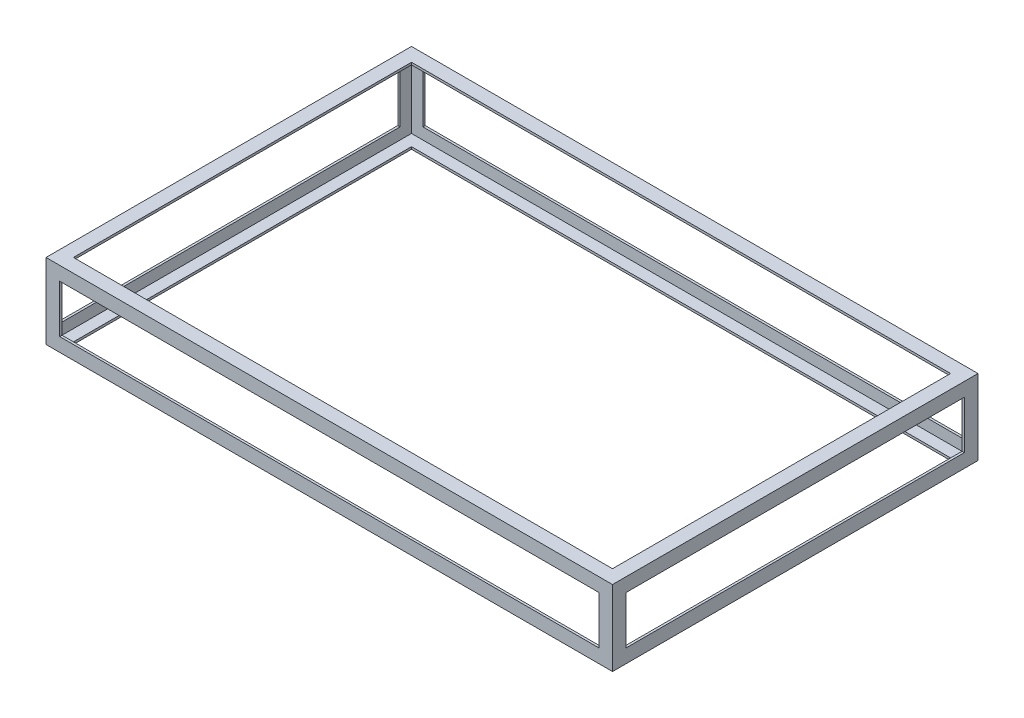
ISO-10303-21;
HEADER;
FILE_DESCRIPTION(('STEP AP214'),'2;1');
FILE_NAME('part.step','',(''),(''),'','','');
FILE_SCHEMA(('AUTOMOTIVE_DESIGN { 1 0 10303 214 1 1 1 1 }'));
ENDSEC;
DATA;
#1=APPLICATION_CONTEXT('core data for automotive mechanical design processes');
#2=APPLICATION_PROTOCOL_DEFINITION('international standard','automotive_design',2000,#1);
#3=PRODUCT_CONTEXT('',#1,'mechanical');
#4=PRODUCT('Part','Part','',(#3));
#5=PRODUCT_RELATED_PRODUCT_CATEGORY('part','',(#4));
#6=PRODUCT_DEFINITION_FORMATION('','',#4);
#7=PRODUCT_DEFINITION_CONTEXT('part definition',#1,'design');
#8=PRODUCT_DEFINITION('design','',#6,#7);
#9=PRODUCT_DEFINITION_SHAPE('','',#8);
#10=(LENGTH_UNIT() NAMED_UNIT(*) SI_UNIT(.MILLI.,.METRE.));
#11=(NAMED_UNIT(*) PLANE_ANGLE_UNIT() SI_UNIT($,.RADIAN.));
#12=(NAMED_UNIT(*) SI_UNIT($,.STERADIAN.) SOLID_ANGLE_UNIT());
#13=UNCERTAINTY_MEASURE_WITH_UNIT(LENGTH_MEASURE(1.E-05),#10,'distance_accuracy_value','');
#14=(GEOMETRIC_REPRESENTATION_CONTEXT(3) GLOBAL_UNCERTAINTY_ASSIGNED_CONTEXT((#13)) GLOBAL_UNIT_ASSIGNED_CONTEXT((#10,
#11,#12)) REPRESENTATION_CONTEXT('',''));
#15=CARTESIAN_POINT('',(0.,0.,0.));
#16=DIRECTION('',(0.,0.,1.));
#17=DIRECTION('',(1.,0.,0.));
#18=AXIS2_PLACEMENT_3D('',#15,#16,#17);
#19=CARTESIAN_POINT('',(1574.8,-304.8,469.9));
#20=DIRECTION('',(0.,0.,1.));
#21=DIRECTION('',(1.,0.,0.));
#22=AXIS2_PLACEMENT_3D('',#19,#20,#21);
#23=PLANE('',#22);
#24=DIRECTION('',(0.,1.,0.));
#25=VECTOR('',#24,1.);
#26=CARTESIAN_POINT('',(1574.8,-304.8,469.9));
#27=LINE('',#26,#25);
#28=CARTESIAN_POINT('',(1574.8,-266.699999999998,469.9));
#29=VERTEX_POINT('',#28);
#30=CARTESIAN_POINT('',(1574.8,-133.349999999999,469.9));
#31=VERTEX_POINT('',#30);
#32=EDGE_CURVE('E461',#29,#31,#27,.T.);
#33=ORIENTED_EDGE('',*,*,#32,.F.);
#34=DIRECTION('',(-1.,-2.44773580232324E-13,0.));
#35=VECTOR('',#34,1.);
#36=CARTESIAN_POINT('',(1574.79999999999,-266.699999999998,469.9));
#37=LINE('',#36,#35);
#38=CARTESIAN_POINT('',(1568.45,-266.7,469.9));
#39=VERTEX_POINT('',#38);
#40=EDGE_CURVE('E276',#29,#39,#37,.T.);
#41=ORIENTED_EDGE('',*,*,#40,.T.);
#42=DIRECTION('',(0.,-1.,0.));
#43=VECTOR('',#42,1.);
#44=CARTESIAN_POINT('',(1568.45,-95.2500000000007,469.9));
#45=LINE('',#44,#43);
#46=CARTESIAN_POINT('',(1568.45,-133.350000000001,469.9));
#47=VERTEX_POINT('',#46);
#48=EDGE_CURVE('E442',#47,#39,#45,.T.);
#49=ORIENTED_EDGE('',*,*,#48,.F.);
#50=DIRECTION('',(1.,2.27289753072872E-13,0.));
#51=VECTOR('',#50,1.);
#52=CARTESIAN_POINT('',(1574.79999999996,-133.349999999999,469.9));
#53=LINE('',#52,#51);
#54=EDGE_CURVE('E312',#47,#31,#53,.T.);
#55=ORIENTED_EDGE('',*,*,#54,.T.);
#56=EDGE_LOOP('',(#33,#41,#49,#55));
#57=FACE_BOUND('',#56,.T.);
#58=ADVANCED_FACE('F37',(#57),#23,.F.);
#59=CARTESIAN_POINT('',(1574.8,-304.8,-469.9));
#60=DIRECTION('',(0.,0.,-1.));
#61=DIRECTION('',(-1.,0.,0.));
#62=AXIS2_PLACEMENT_3D('',#59,#60,#61);
#63=PLANE('',#62);
#64=DIRECTION('',(0.,-1.,0.));
#65=VECTOR('',#64,1.);
#66=CARTESIAN_POINT('',(1568.45,-95.2500000000007,-469.9));
#67=LINE('',#66,#65);
#68=CARTESIAN_POINT('',(1568.45,-133.350000000001,-469.9));
#69=VERTEX_POINT('',#68);
#70=CARTESIAN_POINT('',(1568.45,-266.7,-469.9));
#71=VERTEX_POINT('',#70);
#72=EDGE_CURVE('E52',#69,#71,#67,.T.);
#73=ORIENTED_EDGE('',*,*,#72,.T.);
#74=DIRECTION('',(1.,2.44773580232324E-13,0.));
#75=VECTOR('',#74,1.);
#76=CARTESIAN_POINT('',(1574.79999999999,-266.699999999998,-469.9));
#77=LINE('',#76,#75);
#78=CARTESIAN_POINT('',(1574.8,-266.699999999998,-469.9));
#79=VERTEX_POINT('',#78);
#80=EDGE_CURVE('E274',#71,#79,#77,.T.);
#81=ORIENTED_EDGE('',*,*,#80,.T.);
#82=DIRECTION('',(0.,-1.,0.));
#83=VECTOR('',#82,1.);
#84=CARTESIAN_POINT('',(1574.8,-304.8,-469.9));
#85=LINE('',#84,#83);
#86=CARTESIAN_POINT('',(1574.8,-133.349999999999,-469.9));
#87=VERTEX_POINT('',#86);
#88=EDGE_CURVE('E358',#87,#79,#85,.T.);
#89=ORIENTED_EDGE('',*,*,#88,.F.);
#90=DIRECTION('',(-1.,-2.27289753072872E-13,0.));
#91=VECTOR('',#90,1.);
#92=CARTESIAN_POINT('',(1574.79999999996,-133.349999999999,-469.9));
#93=LINE('',#92,#91);
#94=EDGE_CURVE('E303',#87,#69,#93,.T.);
#95=ORIENTED_EDGE('',*,*,#94,.T.);
#96=EDGE_LOOP('',(#73,#81,#89,#95));
#97=FACE_BOUND('',#96,.T.);
#98=ADVANCED_FACE('F529',(#97),#63,.F.);
#99=DIRECTION('',(0.,-1.,0.));
#100=VECTOR('',#99,1.);
#101=CARTESIAN_POINT('',(6.35000000000008,-95.2500000000007,469.9));
#102=LINE('',#101,#100);
#103=CARTESIAN_POINT('',(6.35000000000008,-133.350000000001,469.9));
#104=VERTEX_POINT('',#103);
#105=CARTESIAN_POINT('',(6.35000000000002,-266.7,469.9));
#106=VERTEX_POINT('',#105);
#107=EDGE_CURVE('E403',#104,#106,#102,.T.);
#108=ORIENTED_EDGE('',*,*,#107,.T.);
#109=DIRECTION('',(-1.,2.44773580232317E-13,0.));
#110=VECTOR('',#109,1.);
#111=CARTESIAN_POINT('',(1574.80000000001,-266.700000000384,469.9));
#112=LINE('',#111,#110);
#113=CARTESIAN_POINT('',(0.,-266.699999999998,469.9));
#114=VERTEX_POINT('',#113);
#115=EDGE_CURVE('E296',#106,#114,#112,.T.);
#116=ORIENTED_EDGE('',*,*,#115,.T.);
#117=DIRECTION('',(0.,1.,0.));
#118=VECTOR('',#117,1.);
#119=CARTESIAN_POINT('',(0.,-304.8,469.9));
#120=LINE('',#119,#118);
#121=CARTESIAN_POINT('',(0.,-133.349999999999,469.9));
#122=VERTEX_POINT('',#121);
#123=EDGE_CURVE('E459',#114,#122,#120,.T.);
#124=ORIENTED_EDGE('',*,*,#123,.T.);
#125=DIRECTION('',(1.,-2.27289753072872E-13,0.));
#126=VECTOR('',#125,1.);
#127=CARTESIAN_POINT('',(1574.80000000004,-133.350000000357,469.9));
#128=LINE('',#127,#126);
#129=EDGE_CURVE('E389',#122,#104,#128,.T.);
#130=ORIENTED_EDGE('',*,*,#129,.T.);
#131=EDGE_LOOP('',(#108,#116,#124,#130));
#132=FACE_BOUND('',#131,.T.);
#133=ADVANCED_FACE('F505',(#132),#23,.F.);
#134=DIRECTION('',(0.,-1.,0.));
#135=VECTOR('',#134,1.);
#136=CARTESIAN_POINT('',(0.,-304.8,-469.9));
#137=LINE('',#136,#135);
#138=CARTESIAN_POINT('',(0.,-133.349999999999,-469.9));
#139=VERTEX_POINT('',#138);
#140=CARTESIAN_POINT('',(0.,-266.699999999998,-469.9));
#141=VERTEX_POINT('',#140);
#142=EDGE_CURVE('E355',#139,#141,#137,.T.);
#143=ORIENTED_EDGE('',*,*,#142,.T.);
#144=DIRECTION('',(1.,-2.44773580232317E-13,0.));
#145=VECTOR('',#144,1.);
#146=CARTESIAN_POINT('',(1574.80000000001,-266.700000000384,-469.9));
#147=LINE('',#146,#145);
#148=CARTESIAN_POINT('',(6.35000000000002,-266.7,-469.9));
#149=VERTEX_POINT('',#148);
#150=EDGE_CURVE('E293',#141,#149,#147,.T.);
#151=ORIENTED_EDGE('',*,*,#150,.T.);
#152=DIRECTION('',(0.,-1.,0.));
#153=VECTOR('',#152,1.);
#154=CARTESIAN_POINT('',(6.35000000000008,-95.2500000000007,-469.9));
#155=LINE('',#154,#153);
#156=CARTESIAN_POINT('',(6.35000000000008,-133.350000000001,-469.9));
#157=VERTEX_POINT('',#156);
#158=EDGE_CURVE('E319',#157,#149,#155,.T.);
#159=ORIENTED_EDGE('',*,*,#158,.F.);
#160=DIRECTION('',(1.,-2.27289753072872E-13,0.));
#161=VECTOR('',#160,1.);
#162=CARTESIAN_POINT('',(6.34999999999986,-133.350000000001,-469.9));
#163=LINE('',#162,#161);
#164=EDGE_CURVE('E45',#139,#157,#163,.T.);
#165=ORIENTED_EDGE('',*,*,#164,.F.);
#166=EDGE_LOOP('',(#143,#151,#159,#165));
#167=FACE_BOUND('',#166,.T.);
#168=ADVANCED_FACE('F499',(#167),#63,.F.);
#169=DIRECTION('',(-1.,0.,0.));
#170=VECTOR('',#169,1.);
#171=CARTESIAN_POINT('',(1574.8,-298.45,469.9));
#172=LINE('',#171,#170);
#173=CARTESIAN_POINT('',(1536.7,-298.45,469.9));
#174=VERTEX_POINT('',#173);
#175=CARTESIAN_POINT('',(38.1,-298.45,469.9));
#176=VERTEX_POINT('',#175);
#177=EDGE_CURVE('E463',#174,#176,#172,.T.);
#178=ORIENTED_EDGE('',*,*,#177,.F.);
#179=DIRECTION('',(0.,-1.,0.));
#180=VECTOR('',#179,1.);
#181=CARTESIAN_POINT('',(1536.7,-304.8,469.9));
#182=LINE('',#181,#180);
#183=CARTESIAN_POINT('',(1536.7,-304.799999999998,469.9));
#184=VERTEX_POINT('',#183);
#185=EDGE_CURVE('E261',#174,#184,#182,.T.);
#186=ORIENTED_EDGE('',*,*,#185,.T.);
#187=DIRECTION('',(-1.,0.,0.));
#188=VECTOR('',#187,1.);
#189=CARTESIAN_POINT('',(1574.8,-304.8,469.9));
#190=LINE('',#189,#188);
#191=CARTESIAN_POINT('',(38.1,-304.799999999998,469.9));
#192=VERTEX_POINT('',#191);
#193=EDGE_CURVE('E471',#184,#192,#190,.T.);
#194=ORIENTED_EDGE('',*,*,#193,.T.);
#195=DIRECTION('',(0.,1.,0.));
#196=VECTOR('',#195,1.);
#197=CARTESIAN_POINT('',(38.1,-304.8,469.9));
#198=LINE('',#197,#196);
#199=EDGE_CURVE('E290',#192,#176,#198,.T.);
#200=ORIENTED_EDGE('',*,*,#199,.T.);
#201=EDGE_LOOP('',(#178,#186,#194,#200));
#202=FACE_BOUND('',#201,.T.);
#203=ADVANCED_FACE('F542',(#202),#23,.F.);
#204=DIRECTION('',(-1.,0.,0.));
#205=VECTOR('',#204,1.);
#206=CARTESIAN_POINT('',(1574.8,-304.8,-469.9));
#207=LINE('',#206,#205);
#208=CARTESIAN_POINT('',(1536.7,-304.8,-469.9));
#209=VERTEX_POINT('',#208);
#210=CARTESIAN_POINT('',(38.1,-304.8,-469.9));
#211=VERTEX_POINT('',#210);
#212=EDGE_CURVE('E254',#209,#211,#207,.T.);
#213=ORIENTED_EDGE('',*,*,#212,.F.);
#214=DIRECTION('',(0.,1.,0.));
#215=VECTOR('',#214,1.);
#216=CARTESIAN_POINT('',(1536.7,-304.8,-469.9));
#217=LINE('',#216,#215);
#218=CARTESIAN_POINT('',(1536.7,-298.45,-469.9));
#219=VERTEX_POINT('',#218);
#220=EDGE_CURVE('E257',#209,#219,#217,.T.);
#221=ORIENTED_EDGE('',*,*,#220,.T.);
#222=DIRECTION('',(-1.,0.,0.));
#223=VECTOR('',#222,1.);
#224=CARTESIAN_POINT('',(1574.8,-298.45,-469.9));
#225=LINE('',#224,#223);
#226=CARTESIAN_POINT('',(38.1,-298.45,-469.9));
#227=VERTEX_POINT('',#226);
#228=EDGE_CURVE('E245',#219,#227,#225,.T.);
#229=ORIENTED_EDGE('',*,*,#228,.T.);
#230=DIRECTION('',(0.,-1.,0.));
#231=VECTOR('',#230,1.);
#232=CARTESIAN_POINT('',(38.1,-304.8,-469.9));
#233=LINE('',#232,#231);
#234=EDGE_CURVE('E282',#227,#211,#233,.T.);
#235=ORIENTED_EDGE('',*,*,#234,.T.);
#236=EDGE_LOOP('',(#213,#221,#229,#235));
#237=FACE_BOUND('',#236,.T.);
#238=ADVANCED_FACE('F258',(#237),#63,.F.);
#239=CARTESIAN_POINT('',(1574.8,-101.6,469.9));
#240=DIRECTION('',(0.,1.,0.));
#241=DIRECTION('',(0.,0.,1.));
#242=AXIS2_PLACEMENT_3D('',#239,#240,#241);
#243=PLANE('',#242);
#244=DIRECTION('',(0.,0.,1.));
#245=VECTOR('',#244,1.);
#246=CARTESIAN_POINT('',(1536.7,-101.600000000001,-561.881536726417));
#247=LINE('',#246,#245);
#248=CARTESIAN_POINT('',(1536.7,-101.600000000001,-469.9));
#249=VERTEX_POINT('',#248);
#250=CARTESIAN_POINT('',(1536.7,-101.6,469.9));
#251=VERTEX_POINT('',#250);
#252=EDGE_CURVE('E307',#249,#251,#247,.T.);
#253=ORIENTED_EDGE('',*,*,#252,.F.);
#254=DIRECTION('',(-1.,0.,0.));
#255=VECTOR('',#254,1.);
#256=CARTESIAN_POINT('',(1574.8,-101.6,-469.9));
#257=LINE('',#256,#255);
#258=CARTESIAN_POINT('',(38.1,-101.600000000001,-469.9));
#259=VERTEX_POINT('',#258);
#260=EDGE_CURVE('E340',#249,#259,#257,.T.);
#261=ORIENTED_EDGE('',*,*,#260,.T.);
#262=DIRECTION('',(0.,0.,1.));
#263=VECTOR('',#262,1.);
#264=CARTESIAN_POINT('',(38.1,-101.600000000001,-561.881536726417));
#265=LINE('',#264,#263);
#266=CARTESIAN_POINT('',(38.1,-101.600000000001,469.9));
#267=VERTEX_POINT('',#266);
#268=EDGE_CURVE('E391',#259,#267,#265,.T.);
#269=ORIENTED_EDGE('',*,*,#268,.T.);
#270=DIRECTION('',(-1.,0.,0.));
#271=VECTOR('',#270,1.);
#272=CARTESIAN_POINT('',(1574.8,-101.6,469.9));
#273=LINE('',#272,#271);
#274=EDGE_CURVE('E423',#251,#267,#273,.T.);
#275=ORIENTED_EDGE('',*,*,#274,.F.);
#276=EDGE_LOOP('',(#253,#261,#269,#275));
#277=FACE_BOUND('',#276,.T.);
#278=DIRECTION('',(0.,0.,-1.));
#279=VECTOR('',#278,1.);
#280=CARTESIAN_POINT('',(6.35000000000008,-101.6,469.900000000022));
#281=LINE('',#280,#279);
#282=CARTESIAN_POINT('',(6.35000000000052,-101.6,501.65));
#283=VERTEX_POINT('',#282);
#284=CARTESIAN_POINT('',(6.34999999998649,-101.6,-501.65));
#285=VERTEX_POINT('',#284);
#286=EDGE_CURVE('E486',#283,#285,#281,.T.);
#287=ORIENTED_EDGE('',*,*,#286,.T.);
#288=DIRECTION('',(-1.,0.,0.));
#289=VECTOR('',#288,1.);
#290=CARTESIAN_POINT('',(1574.8,-101.6,-501.65));
#291=LINE('',#290,#289);
#292=CARTESIAN_POINT('',(1568.45,-101.6,-501.65));
#293=VERTEX_POINT('',#292);
#294=EDGE_CURVE('E338',#293,#285,#291,.T.);
#295=ORIENTED_EDGE('',*,*,#294,.F.);
#296=DIRECTION('',(0.,0.,-1.));
#297=VECTOR('',#296,1.);
#298=CARTESIAN_POINT('',(1568.45,-101.6,469.9));
#299=LINE('',#298,#297);
#300=CARTESIAN_POINT('',(1568.45,-101.6,501.65));
#301=VERTEX_POINT('',#300);
#302=EDGE_CURVE('E482',#301,#293,#299,.T.);
#303=ORIENTED_EDGE('',*,*,#302,.F.);
#304=DIRECTION('',(-1.,0.,0.));
#305=VECTOR('',#304,1.);
#306=CARTESIAN_POINT('',(1574.8,-101.6,501.65));
#307=LINE('',#306,#305);
#308=EDGE_CURVE('E425',#301,#283,#307,.T.);
#309=ORIENTED_EDGE('',*,*,#308,.T.);
#310=EDGE_LOOP('',(#287,#295,#303,#309));
#311=FACE_BOUND('',#310,.T.);
#312=ADVANCED_FACE('F561',(#277,#311),#243,.F.);
#313=CARTESIAN_POINT('',(6.35000000000008,-95.2500000000007,469.9));
#314=DIRECTION('',(1.,0.,0.));
#315=DIRECTION('',(0.,0.,-1.));
#316=AXIS2_PLACEMENT_3D('',#313,#314,#315);
#317=PLANE('',#316);
#318=DIRECTION('',(0.,0.,1.));
#319=VECTOR('',#318,1.);
#320=CARTESIAN_POINT('',(6.35000000000002,-266.7,-561.881536726417));
#321=LINE('',#320,#319);
#322=EDGE_CURVE('E283',#149,#106,#321,.T.);
#323=ORIENTED_EDGE('',*,*,#322,.T.);
#324=ORIENTED_EDGE('',*,*,#107,.F.);
#325=DIRECTION('',(0.,0.,1.));
#326=VECTOR('',#325,1.);
#327=CARTESIAN_POINT('',(6.34999999999986,-133.350000000001,-561.881536726417));
#328=LINE('',#327,#326);
#329=EDGE_CURVE('E394',#157,#104,#328,.T.);
#330=ORIENTED_EDGE('',*,*,#329,.F.);
#331=ORIENTED_EDGE('',*,*,#158,.T.);
#332=EDGE_LOOP('',(#323,#324,#330,#331));
#333=FACE_BOUND('',#332,.T.);
#334=DIRECTION('',(0.,0.,1.));
#335=VECTOR('',#334,1.);
#336=CARTESIAN_POINT('',(6.35000000000008,-298.45,469.900000000022));
#337=LINE('',#336,#335);
#338=CARTESIAN_POINT('',(6.35000000000052,-298.45,-501.65));
#339=VERTEX_POINT('',#338);
#340=CARTESIAN_POINT('',(6.3500000000003,-298.45,501.65));
#341=VERTEX_POINT('',#340);
#342=EDGE_CURVE('E407',#339,#341,#337,.T.);
#343=ORIENTED_EDGE('',*,*,#342,.F.);
#344=DIRECTION('',(0.,-1.,0.));
#345=VECTOR('',#344,1.);
#346=CARTESIAN_POINT('',(6.35000000000052,-95.2500000000007,-501.65));
#347=LINE('',#346,#345);
#348=EDGE_CURVE('E323',#285,#339,#347,.T.);
#349=ORIENTED_EDGE('',*,*,#348,.F.);
#350=ORIENTED_EDGE('',*,*,#286,.F.);
#351=DIRECTION('',(0.,-1.,0.));
#352=VECTOR('',#351,1.);
#353=CARTESIAN_POINT('',(6.35000000000052,-95.2500000000007,501.65));
#354=LINE('',#353,#352);
#355=EDGE_CURVE('E411',#283,#341,#354,.T.);
#356=ORIENTED_EDGE('',*,*,#355,.T.);
#357=EDGE_LOOP('',(#343,#349,#350,#356));
#358=FACE_BOUND('',#357,.T.);
#359=ADVANCED_FACE('F501',(#333,#358),#317,.T.);
#360=CARTESIAN_POINT('',(38.1,-95.2499999999992,-561.881536726417));
#361=DIRECTION('',(1.,0.,0.));
#362=DIRECTION('',(0.,0.,-1.));
#363=AXIS2_PLACEMENT_3D('',#360,#361,#362);
#364=PLANE('',#363);
#365=ORIENTED_EDGE('',*,*,#268,.F.);
#366=DIRECTION('',(0.,1.,0.));
#367=VECTOR('',#366,1.);
#368=CARTESIAN_POINT('',(38.1,-95.2499999999992,-469.9));
#369=LINE('',#368,#367);
#370=CARTESIAN_POINT('',(38.1,-95.2499999999992,-469.9));
#371=VERTEX_POINT('',#370);
#372=EDGE_CURVE('E379',#259,#371,#369,.T.);
#373=ORIENTED_EDGE('',*,*,#372,.T.);
#374=DIRECTION('',(0.,0.,1.));
#375=VECTOR('',#374,1.);
#376=CARTESIAN_POINT('',(38.1,-95.2499999999992,-561.881536726417));
#377=LINE('',#376,#375);
#378=CARTESIAN_POINT('',(38.1,-95.2499999999992,469.9));
#379=VERTEX_POINT('',#378);
#380=EDGE_CURVE('E387',#371,#379,#377,.T.);
#381=ORIENTED_EDGE('',*,*,#380,.T.);
#382=DIRECTION('',(0.,1.,0.));
#383=VECTOR('',#382,1.);
#384=CARTESIAN_POINT('',(38.1,-304.8,469.9));
#385=LINE('',#384,#383);
#386=EDGE_CURVE('E400',#267,#379,#385,.T.);
#387=ORIENTED_EDGE('',*,*,#386,.F.);
#388=EDGE_LOOP('',(#365,#373,#381,#387));
#389=FACE_BOUND('',#388,.T.);
#390=ADVANCED_FACE('F619',(#389),#364,.T.);
#391=CARTESIAN_POINT('',(6.34999999999986,-133.350000000001,-561.881536726417));
#392=DIRECTION('',(-2.27289753072872E-13,-1.,0.));
#393=DIRECTION('',(1.,-2.27289753072872E-13,0.));
#394=AXIS2_PLACEMENT_3D('',#391,#392,#393);
#395=PLANE('',#394);
#396=DIRECTION('',(0.,0.,1.));
#397=VECTOR('',#396,1.);
#398=CARTESIAN_POINT('',(0.,-133.349999999999,-561.881536726417));
#399=LINE('',#398,#397);
#400=EDGE_CURVE('E382',#139,#122,#399,.T.);
#401=ORIENTED_EDGE('',*,*,#400,.F.);
#402=ORIENTED_EDGE('',*,*,#164,.T.);
#403=ORIENTED_EDGE('',*,*,#329,.T.);
#404=ORIENTED_EDGE('',*,*,#129,.F.);
#405=EDGE_LOOP('',(#401,#402,#403,#404));
#406=FACE_BOUND('',#405,.T.);
#407=ADVANCED_FACE('F495',(#406),#395,.T.);
#408=CARTESIAN_POINT('',(1574.8,-298.45,501.65));
#409=DIRECTION('',(0.,0.,1.));
#410=DIRECTION('',(1.,0.,0.));
#411=AXIS2_PLACEMENT_3D('',#408,#409,#410);
#412=PLANE('',#411);
#413=DIRECTION('',(0.,-1.,0.));
#414=VECTOR('',#413,1.);
#415=CARTESIAN_POINT('',(38.1,-95.2500000000007,501.65));
#416=LINE('',#415,#414);
#417=CARTESIAN_POINT('',(38.1,-133.35,501.65));
#418=VERTEX_POINT('',#417);
#419=CARTESIAN_POINT('',(38.1,-266.7,501.65));
#420=VERTEX_POINT('',#419);
#421=EDGE_CURVE('E408',#418,#420,#416,.T.);
#422=ORIENTED_EDGE('',*,*,#421,.T.);
#423=DIRECTION('',(-1.,0.,0.));
#424=VECTOR('',#423,1.);
#425=CARTESIAN_POINT('',(1574.8,-266.7,501.65));
#426=LINE('',#425,#424);
#427=CARTESIAN_POINT('',(1536.7,-266.7,501.65));
#428=VERTEX_POINT('',#427);
#429=EDGE_CURVE('E478',#428,#420,#426,.T.);
#430=ORIENTED_EDGE('',*,*,#429,.F.);
#431=DIRECTION('',(0.,-1.,0.));
#432=VECTOR('',#431,1.);
#433=CARTESIAN_POINT('',(1536.7,-95.2500000000007,501.65));
#434=LINE('',#433,#432);
#435=CARTESIAN_POINT('',(1536.7,-133.35,501.65));
#436=VERTEX_POINT('',#435);
#437=EDGE_CURVE('E448',#436,#428,#434,.T.);
#438=ORIENTED_EDGE('',*,*,#437,.F.);
#439=DIRECTION('',(-1.,0.,0.));
#440=VECTOR('',#439,1.);
#441=CARTESIAN_POINT('',(1574.8,-133.35,501.65));
#442=LINE('',#441,#440);
#443=EDGE_CURVE('E427',#436,#418,#442,.T.);
#444=ORIENTED_EDGE('',*,*,#443,.T.);
#445=EDGE_LOOP('',(#422,#430,#438,#444));
#446=FACE_BOUND('',#445,.T.);
#447=DIRECTION('',(-1.,0.,0.));
#448=VECTOR('',#447,1.);
#449=CARTESIAN_POINT('',(1574.8,-298.45,501.65));
#450=LINE('',#449,#448);
#451=CARTESIAN_POINT('',(1568.45,-298.45,501.65));
#452=VERTEX_POINT('',#451);
#453=EDGE_CURVE('E480',#452,#341,#450,.T.);
#454=ORIENTED_EDGE('',*,*,#453,.T.);
#455=ORIENTED_EDGE('',*,*,#355,.F.);
#456=ORIENTED_EDGE('',*,*,#308,.F.);
#457=DIRECTION('',(0.,-1.,0.));
#458=VECTOR('',#457,1.);
#459=CARTESIAN_POINT('',(1568.45,-95.2500000000007,501.65));
#460=LINE('',#459,#458);
#461=EDGE_CURVE('E446',#301,#452,#460,.T.);
#462=ORIENTED_EDGE('',*,*,#461,.T.);
#463=EDGE_LOOP('',(#454,#455,#456,#462));
#464=FACE_BOUND('',#463,.T.);
#465=ADVANCED_FACE('F602',(#446,#464),#412,.F.);
#466=CARTESIAN_POINT('',(1536.7,-95.2500000000007,501.65));
#467=DIRECTION('',(-1.,0.,0.));
#468=DIRECTION('',(0.,0.,1.));
#469=AXIS2_PLACEMENT_3D('',#466,#467,#468);
#470=PLANE('',#469);
#471=DIRECTION('',(0.,-1.,0.));
#472=VECTOR('',#471,1.);
#473=CARTESIAN_POINT('',(1536.7,-95.2500000000007,508.));
#474=LINE('',#473,#472);
#475=CARTESIAN_POINT('',(1536.7,-133.35,508.));
#476=VERTEX_POINT('',#475);
#477=CARTESIAN_POINT('',(1536.7,-266.7,508.));
#478=VERTEX_POINT('',#477);
#479=EDGE_CURVE('E441',#476,#478,#474,.T.);
#480=ORIENTED_EDGE('',*,*,#479,.F.);
#481=DIRECTION('',(0.,0.,-1.));
#482=VECTOR('',#481,1.);
#483=CARTESIAN_POINT('',(1536.7,-133.35,501.65));
#484=LINE('',#483,#482);
#485=EDGE_CURVE('E484',#476,#436,#484,.T.);
#486=ORIENTED_EDGE('',*,*,#485,.T.);
#487=ORIENTED_EDGE('',*,*,#437,.T.);
#488=DIRECTION('',(0.,0.,-1.));
#489=VECTOR('',#488,1.);
#490=CARTESIAN_POINT('',(1536.7,-266.7,501.65));
#491=LINE('',#490,#489);
#492=EDGE_CURVE('E452',#478,#428,#491,.T.);
#493=ORIENTED_EDGE('',*,*,#492,.F.);
#494=EDGE_LOOP('',(#480,#486,#487,#493));
#495=FACE_BOUND('',#494,.T.);
#496=ADVANCED_FACE('F606',(#495),#470,.T.);
#497=CARTESIAN_POINT('',(1568.45,-95.2500000000007,469.9));
#498=DIRECTION('',(-1.,0.,0.));
#499=DIRECTION('',(0.,0.,1.));
#500=AXIS2_PLACEMENT_3D('',#497,#498,#499);
#501=PLANE('',#500);
#502=DIRECTION('',(0.,-1.,0.));
#503=VECTOR('',#502,1.);
#504=CARTESIAN_POINT('',(1568.45,-95.2500000000007,-501.65));
#505=LINE('',#504,#503);
#506=CARTESIAN_POINT('',(1568.45,-298.45,-501.65));
#507=VERTEX_POINT('',#506);
#508=EDGE_CURVE('E344',#293,#507,#505,.T.);
#509=ORIENTED_EDGE('',*,*,#508,.T.);
#510=DIRECTION('',(0.,0.,-1.));
#511=VECTOR('',#510,1.);
#512=CARTESIAN_POINT('',(1568.45,-298.45,469.9));
#513=LINE('',#512,#511);
#514=EDGE_CURVE('E445',#452,#507,#513,.T.);
#515=ORIENTED_EDGE('',*,*,#514,.F.);
#516=ORIENTED_EDGE('',*,*,#461,.F.);
#517=ORIENTED_EDGE('',*,*,#302,.T.);
#518=EDGE_LOOP('',(#509,#515,#516,#517));
#519=FACE_BOUND('',#518,.T.);
#520=ORIENTED_EDGE('',*,*,#48,.T.);
#521=DIRECTION('',(0.,0.,1.));
#522=VECTOR('',#521,1.);
#523=CARTESIAN_POINT('',(1568.45,-266.7,-561.881536726417));
#524=LINE('',#523,#522);
#525=EDGE_CURVE('E262',#71,#39,#524,.T.);
#526=ORIENTED_EDGE('',*,*,#525,.F.);
#527=ORIENTED_EDGE('',*,*,#72,.F.);
#528=DIRECTION('',(0.,0.,1.));
#529=VECTOR('',#528,1.);
#530=CARTESIAN_POINT('',(1568.45,-133.350000000001,-561.881536726417));
#531=LINE('',#530,#529);
#532=EDGE_CURVE('E304',#69,#47,#531,.T.);
#533=ORIENTED_EDGE('',*,*,#532,.T.);
#534=EDGE_LOOP('',(#520,#526,#527,#533));
#535=FACE_BOUND('',#534,.T.);
#536=ADVANCED_FACE('F612',(#519,#535),#501,.T.);
#537=CARTESIAN_POINT('',(1574.8,-298.45,469.9));
#538=DIRECTION('',(0.,-1.,0.));
#539=DIRECTION('',(0.,0.,-1.));
#540=AXIS2_PLACEMENT_3D('',#537,#538,#539);
#541=PLANE('',#540);
#542=DIRECTION('',(0.,0.,1.));
#543=VECTOR('',#542,1.);
#544=CARTESIAN_POINT('',(1536.7,-298.45,-561.881536726417));
#545=LINE('',#544,#543);
#546=EDGE_CURVE('E60',#219,#174,#545,.T.);
#547=ORIENTED_EDGE('',*,*,#546,.T.);
#548=ORIENTED_EDGE('',*,*,#177,.T.);
#549=DIRECTION('',(0.,0.,1.));
#550=VECTOR('',#549,1.);
#551=CARTESIAN_POINT('',(38.1,-298.45,-561.881536726417));
#552=LINE('',#551,#550);
#553=EDGE_CURVE('E249',#227,#176,#552,.T.);
#554=ORIENTED_EDGE('',*,*,#553,.F.);
#555=ORIENTED_EDGE('',*,*,#228,.F.);
#556=EDGE_LOOP('',(#547,#548,#554,#555));
#557=FACE_BOUND('',#556,.T.);
#558=ORIENTED_EDGE('',*,*,#342,.T.);
#559=ORIENTED_EDGE('',*,*,#453,.F.);
#560=ORIENTED_EDGE('',*,*,#514,.T.);
#561=DIRECTION('',(-1.,0.,0.));
#562=VECTOR('',#561,1.);
#563=CARTESIAN_POINT('',(1574.8,-298.45,-501.65));
#564=LINE('',#563,#562);
#565=EDGE_CURVE('E253',#507,#339,#564,.T.);
#566=ORIENTED_EDGE('',*,*,#565,.T.);
#567=EDGE_LOOP('',(#558,#559,#560,#566));
#568=FACE_BOUND('',#567,.T.);
#569=ADVANCED_FACE('F39',(#557,#568),#541,.F.);
#570=CARTESIAN_POINT('',(1574.8,-266.7,501.65));
#571=DIRECTION('',(0.,-1.,0.));
#572=DIRECTION('',(0.,0.,-1.));
#573=AXIS2_PLACEMENT_3D('',#570,#571,#572);
#574=PLANE('',#573);
#575=ORIENTED_EDGE('',*,*,#429,.T.);
#576=DIRECTION('',(0.,0.,1.));
#577=VECTOR('',#576,1.);
#578=CARTESIAN_POINT('',(38.1,-266.7,501.65));
#579=LINE('',#578,#577);
#580=CARTESIAN_POINT('',(38.1,-266.7,508.));
#581=VERTEX_POINT('',#580);
#582=EDGE_CURVE('E418',#420,#581,#579,.T.);
#583=ORIENTED_EDGE('',*,*,#582,.T.);
#584=DIRECTION('',(-1.,0.,0.));
#585=VECTOR('',#584,1.);
#586=CARTESIAN_POINT('',(1574.8,-266.7,508.));
#587=LINE('',#586,#585);
#588=EDGE_CURVE('E475',#478,#581,#587,.T.);
#589=ORIENTED_EDGE('',*,*,#588,.F.);
#590=ORIENTED_EDGE('',*,*,#492,.T.);
#591=EDGE_LOOP('',(#575,#583,#589,#590));
#592=FACE_BOUND('',#591,.T.);
#593=ADVANCED_FACE('F586',(#592),#574,.F.);
#594=CARTESIAN_POINT('',(1574.8,-304.8,508.));
#595=DIRECTION('',(0.,0.,-1.));
#596=DIRECTION('',(0.,1.,0.));
#597=AXIS2_PLACEMENT_3D('',#594,#595,#596);
#598=PLANE('',#597);
#599=DIRECTION('',(-1.,0.,0.));
#600=VECTOR('',#599,1.);
#601=CARTESIAN_POINT('',(1574.8,-304.8,508.));
#602=LINE('',#601,#600);
#603=CARTESIAN_POINT('',(1574.8,-304.8,508.));
#604=VERTEX_POINT('',#603);
#605=CARTESIAN_POINT('',(0.,-304.8,508.));
#606=VERTEX_POINT('',#605);
#607=EDGE_CURVE('E473',#604,#606,#602,.T.);
#608=ORIENTED_EDGE('',*,*,#607,.F.);
#609=DIRECTION('',(0.,-1.,0.));
#610=VECTOR('',#609,1.);
#611=CARTESIAN_POINT('',(1574.8,-304.8,508.));
#612=LINE('',#611,#610);
#613=CARTESIAN_POINT('',(1574.8,-95.2500000000007,508.));
#614=VERTEX_POINT('',#613);
#615=EDGE_CURVE('E456',#614,#604,#612,.T.);
#616=ORIENTED_EDGE('',*,*,#615,.F.);
#617=DIRECTION('',(-1.,0.,0.));
#618=VECTOR('',#617,1.);
#619=CARTESIAN_POINT('',(1574.8,-95.2500000000007,508.));
#620=LINE('',#619,#618);
#621=CARTESIAN_POINT('',(0.,-95.2500000000002,508.));
#622=VERTEX_POINT('',#621);
#623=EDGE_CURVE('E433',#614,#622,#620,.T.);
#624=ORIENTED_EDGE('',*,*,#623,.T.);
#625=DIRECTION('',(0.,-1.,0.));
#626=VECTOR('',#625,1.);
#627=CARTESIAN_POINT('',(0.,-304.8,508.));
#628=LINE('',#627,#626);
#629=EDGE_CURVE('E455',#622,#606,#628,.T.);
#630=ORIENTED_EDGE('',*,*,#629,.T.);
#631=EDGE_LOOP('',(#608,#616,#624,#630));
#632=FACE_BOUND('',#631,.T.);
#633=ORIENTED_EDGE('',*,*,#588,.T.);
#634=DIRECTION('',(0.,-1.,0.));
#635=VECTOR('',#634,1.);
#636=CARTESIAN_POINT('',(38.1,-95.2500000000007,508.));
#637=LINE('',#636,#635);
#638=CARTESIAN_POINT('',(38.1,-133.35,508.));
#639=VERTEX_POINT('',#638);
#640=EDGE_CURVE('E404',#639,#581,#637,.T.);
#641=ORIENTED_EDGE('',*,*,#640,.F.);
#642=DIRECTION('',(-1.,0.,0.));
#643=VECTOR('',#642,1.);
#644=CARTESIAN_POINT('',(1574.8,-133.35,508.));
#645=LINE('',#644,#643);
#646=EDGE_CURVE('E430',#476,#639,#645,.T.);
#647=ORIENTED_EDGE('',*,*,#646,.F.);
#648=ORIENTED_EDGE('',*,*,#479,.T.);
#649=EDGE_LOOP('',(#633,#641,#647,#648));
#650=FACE_BOUND('',#649,.T.);
#651=ADVANCED_FACE('F553',(#632,#650),#598,.F.);
#652=CARTESIAN_POINT('',(1574.8,-304.8,508.));
#653=DIRECTION('',(0.,1.,0.));
#654=DIRECTION('',(0.,0.,1.));
#655=AXIS2_PLACEMENT_3D('',#652,#653,#654);
#656=PLANE('',#655);
#657=ORIENTED_EDGE('',*,*,#193,.F.);
#658=DIRECTION('',(0.,0.,1.));
#659=VECTOR('',#658,1.);
#660=CARTESIAN_POINT('',(1536.7,-304.799999999998,-561.881536726417));
#661=LINE('',#660,#659);
#662=EDGE_CURVE('E267',#209,#184,#661,.T.);
#663=ORIENTED_EDGE('',*,*,#662,.F.);
#664=ORIENTED_EDGE('',*,*,#212,.T.);
#665=DIRECTION('',(0.,0.,1.));
#666=VECTOR('',#665,1.);
#667=CARTESIAN_POINT('',(38.1,-304.799999999998,-561.881536726417));
#668=LINE('',#667,#666);
#669=EDGE_CURVE('E279',#211,#192,#668,.T.);
#670=ORIENTED_EDGE('',*,*,#669,.T.);
#671=EDGE_LOOP('',(#657,#663,#664,#670));
#672=FACE_BOUND('',#671,.T.);
#673=DIRECTION('',(0.,0.,-1.));
#674=VECTOR('',#673,1.);
#675=CARTESIAN_POINT('',(0.,-304.8,508.));
#676=LINE('',#675,#674);
#677=CARTESIAN_POINT('',(0.,-304.8,-508.));
#678=VERTEX_POINT('',#677);
#679=EDGE_CURVE('E466',#606,#678,#676,.T.);
#680=ORIENTED_EDGE('',*,*,#679,.T.);
#681=DIRECTION('',(-1.,0.,0.));
#682=VECTOR('',#681,1.);
#683=CARTESIAN_POINT('',(1574.8,-304.8,-508.));
#684=LINE('',#683,#682);
#685=CARTESIAN_POINT('',(1574.8,-304.8,-508.));
#686=VERTEX_POINT('',#685);
#687=EDGE_CURVE('E361',#686,#678,#684,.T.);
#688=ORIENTED_EDGE('',*,*,#687,.F.);
#689=DIRECTION('',(0.,0.,-1.));
#690=VECTOR('',#689,1.);
#691=CARTESIAN_POINT('',(1574.8,-304.8,508.));
#692=LINE('',#691,#690);
#693=EDGE_CURVE('E458',#604,#686,#692,.T.);
#694=ORIENTED_EDGE('',*,*,#693,.F.);
#695=ORIENTED_EDGE('',*,*,#607,.T.);
#696=EDGE_LOOP('',(#680,#688,#694,#695));
#697=FACE_BOUND('',#696,.T.);
#698=ADVANCED_FACE('F545',(#672,#697),#656,.F.);
#699=DIRECTION('',(1.,0.,0.));
#700=VECTOR('',#699,1.);
#701=CARTESIAN_POINT('',(1574.8,-95.2500000000007,469.9));
#702=LINE('',#701,#700);
#703=CARTESIAN_POINT('',(1536.7,-95.2499999999992,469.9));
#704=VERTEX_POINT('',#703);
#705=EDGE_CURVE('E435',#379,#704,#702,.T.);
#706=ORIENTED_EDGE('',*,*,#705,.T.);
#707=DIRECTION('',(0.,-1.,0.));
#708=VECTOR('',#707,1.);
#709=CARTESIAN_POINT('',(1536.7,-304.8,469.9));
#710=LINE('',#709,#708);
#711=EDGE_CURVE('E315',#704,#251,#710,.T.);
#712=ORIENTED_EDGE('',*,*,#711,.T.);
#713=ORIENTED_EDGE('',*,*,#274,.T.);
#714=ORIENTED_EDGE('',*,*,#386,.T.);
#715=EDGE_LOOP('',(#706,#712,#713,#714));
#716=FACE_BOUND('',#715,.T.);
#717=ADVANCED_FACE('F532',(#716),#23,.F.);
#718=CARTESIAN_POINT('',(1574.8,0.,0.));
#719=DIRECTION('',(-1.,0.,0.));
#720=DIRECTION('',(0.,0.,1.));
#721=AXIS2_PLACEMENT_3D('',#718,#719,#720);
#722=PLANE('',#721);
#723=DIRECTION('',(0.,0.,1.));
#724=VECTOR('',#723,1.);
#725=CARTESIAN_POINT('',(1574.8,-266.699999999998,-561.881536726417));
#726=LINE('',#725,#724);
#727=EDGE_CURVE('E269',#79,#29,#726,.T.);
#728=ORIENTED_EDGE('',*,*,#727,.T.);
#729=ORIENTED_EDGE('',*,*,#32,.T.);
#730=DIRECTION('',(0.,0.,1.));
#731=VECTOR('',#730,1.);
#732=CARTESIAN_POINT('',(1574.8,-133.349999999999,-561.881536726417));
#733=LINE('',#732,#731);
#734=EDGE_CURVE('E300',#87,#31,#733,.T.);
#735=ORIENTED_EDGE('',*,*,#734,.F.);
#736=ORIENTED_EDGE('',*,*,#88,.T.);
#737=EDGE_LOOP('',(#728,#729,#735,#736));
#738=FACE_BOUND('',#737,.T.);
#739=ORIENTED_EDGE('',*,*,#615,.T.);
#740=ORIENTED_EDGE('',*,*,#693,.T.);
#741=DIRECTION('',(0.,1.,0.));
#742=VECTOR('',#741,1.);
#743=CARTESIAN_POINT('',(1574.8,-304.8,-508.));
#744=LINE('',#743,#742);
#745=CARTESIAN_POINT('',(1574.8,-95.2500000000007,-508.));
#746=VERTEX_POINT('',#745);
#747=EDGE_CURVE('E356',#686,#746,#744,.T.);
#748=ORIENTED_EDGE('',*,*,#747,.T.);
#749=DIRECTION('',(0.,0.,1.));
#750=VECTOR('',#749,1.);
#751=CARTESIAN_POINT('',(1574.8,-95.2500000000007,508.));
#752=LINE('',#751,#750);
#753=EDGE_CURVE('E438',#746,#614,#752,.T.);
#754=ORIENTED_EDGE('',*,*,#753,.T.);
#755=EDGE_LOOP('',(#739,#740,#748,#754));
#756=FACE_BOUND('',#755,.T.);
#757=ADVANCED_FACE('F544',(#738,#756),#722,.F.);
#758=CARTESIAN_POINT('',(0.,0.,0.));
#759=DIRECTION('',(-1.,0.,0.));
#760=DIRECTION('',(0.,0.,1.));
#761=AXIS2_PLACEMENT_3D('',#758,#759,#760);
#762=PLANE('',#761);
#763=ORIENTED_EDGE('',*,*,#123,.F.);
#764=DIRECTION('',(0.,0.,1.));
#765=VECTOR('',#764,1.);
#766=CARTESIAN_POINT('',(0.,-266.699999999998,-561.881536726417));
#767=LINE('',#766,#765);
#768=EDGE_CURVE('E280',#141,#114,#767,.T.);
#769=ORIENTED_EDGE('',*,*,#768,.F.);
#770=ORIENTED_EDGE('',*,*,#142,.F.);
#771=ORIENTED_EDGE('',*,*,#400,.T.);
#772=EDGE_LOOP('',(#763,#769,#770,#771));
#773=FACE_BOUND('',#772,.T.);
#774=DIRECTION('',(0.,1.,0.));
#775=VECTOR('',#774,1.);
#776=CARTESIAN_POINT('',(0.,-133.349999999999,-508.000000000001));
#777=LINE('',#776,#775);
#778=CARTESIAN_POINT('',(0.,-95.2499999999991,-508.000000000001));
#779=VERTEX_POINT('',#778);
#780=EDGE_CURVE('E386',#678,#779,#777,.T.);
#781=ORIENTED_EDGE('',*,*,#780,.F.);
#782=ORIENTED_EDGE('',*,*,#679,.F.);
#783=ORIENTED_EDGE('',*,*,#629,.F.);
#784=DIRECTION('',(0.,0.,1.));
#785=VECTOR('',#784,1.);
#786=CARTESIAN_POINT('',(0.,-95.2500000000002,508.));
#787=LINE('',#786,#785);
#788=EDGE_CURVE('E420',#779,#622,#787,.T.);
#789=ORIENTED_EDGE('',*,*,#788,.F.);
#790=EDGE_LOOP('',(#781,#782,#783,#789));
#791=FACE_BOUND('',#790,.T.);
#792=ADVANCED_FACE('F509',(#773,#791),#762,.T.);
#793=CARTESIAN_POINT('',(0.,-95.2500000000007,0.));
#794=DIRECTION('',(0.,1.,0.));
#795=DIRECTION('',(0.,0.,1.));
#796=AXIS2_PLACEMENT_3D('',#793,#794,#795);
#797=PLANE('',#796);
#798=DIRECTION('',(0.,0.,1.));
#799=VECTOR('',#798,1.);
#800=CARTESIAN_POINT('',(1536.7,-95.2499999999992,-561.881536726417));
#801=LINE('',#800,#799);
#802=CARTESIAN_POINT('',(1536.7,-95.2500000000007,-469.9));
#803=VERTEX_POINT('',#802);
#804=EDGE_CURVE('E299',#803,#704,#801,.T.);
#805=ORIENTED_EDGE('',*,*,#804,.T.);
#806=ORIENTED_EDGE('',*,*,#705,.F.);
#807=ORIENTED_EDGE('',*,*,#380,.F.);
#808=DIRECTION('',(-1.,0.,0.));
#809=VECTOR('',#808,1.);
#810=CARTESIAN_POINT('',(1574.8,-95.2500000000007,-469.9));
#811=LINE('',#810,#809);
#812=EDGE_CURVE('E342',#803,#371,#811,.T.);
#813=ORIENTED_EDGE('',*,*,#812,.F.);
#814=EDGE_LOOP('',(#805,#806,#807,#813));
#815=FACE_BOUND('',#814,.T.);
#816=ORIENTED_EDGE('',*,*,#753,.F.);
#817=DIRECTION('',(1.,0.,0.));
#818=VECTOR('',#817,1.);
#819=CARTESIAN_POINT('',(0.,-95.2499999999991,-508.000000000001));
#820=LINE('',#819,#818);
#821=EDGE_CURVE('E383',#779,#746,#820,.T.);
#822=ORIENTED_EDGE('',*,*,#821,.F.);
#823=ORIENTED_EDGE('',*,*,#788,.T.);
#824=ORIENTED_EDGE('',*,*,#623,.F.);
#825=EDGE_LOOP('',(#816,#822,#823,#824));
#826=FACE_BOUND('',#825,.T.);
#827=ADVANCED_FACE('F582',(#815,#826),#797,.T.);
#828=CARTESIAN_POINT('',(1574.8,-133.35,501.65));
#829=DIRECTION('',(0.,1.,0.));
#830=DIRECTION('',(0.,0.,1.));
#831=AXIS2_PLACEMENT_3D('',#828,#829,#830);
#832=PLANE('',#831);
#833=ORIENTED_EDGE('',*,*,#646,.T.);
#834=DIRECTION('',(0.,0.,-1.));
#835=VECTOR('',#834,1.);
#836=CARTESIAN_POINT('',(38.1,-133.35,501.65));
#837=LINE('',#836,#835);
#838=EDGE_CURVE('E489',#639,#418,#837,.T.);
#839=ORIENTED_EDGE('',*,*,#838,.T.);
#840=ORIENTED_EDGE('',*,*,#443,.F.);
#841=ORIENTED_EDGE('',*,*,#485,.F.);
#842=EDGE_LOOP('',(#833,#839,#840,#841));
#843=FACE_BOUND('',#842,.T.);
#844=ADVANCED_FACE('F598',(#843),#832,.F.);
#845=CARTESIAN_POINT('',(38.1,-95.2500000000007,501.65));
#846=DIRECTION('',(1.,0.,0.));
#847=DIRECTION('',(0.,0.,-1.));
#848=AXIS2_PLACEMENT_3D('',#845,#846,#847);
#849=PLANE('',#848);
#850=ORIENTED_EDGE('',*,*,#582,.F.);
#851=ORIENTED_EDGE('',*,*,#421,.F.);
#852=ORIENTED_EDGE('',*,*,#838,.F.);
#853=ORIENTED_EDGE('',*,*,#640,.T.);
#854=EDGE_LOOP('',(#850,#851,#852,#853));
#855=FACE_BOUND('',#854,.T.);
#856=ADVANCED_FACE('F595',(#855),#849,.T.);
#857=CARTESIAN_POINT('',(1574.8,-304.8,-508.));
#858=DIRECTION('',(0.,0.,1.));
#859=DIRECTION('',(0.,-1.,0.));
#860=AXIS2_PLACEMENT_3D('',#857,#858,#859);
#861=PLANE('',#860);
#862=ORIENTED_EDGE('',*,*,#687,.T.);
#863=ORIENTED_EDGE('',*,*,#780,.T.);
#864=ORIENTED_EDGE('',*,*,#821,.T.);
#865=ORIENTED_EDGE('',*,*,#747,.F.);
#866=EDGE_LOOP('',(#862,#863,#864,#865));
#867=FACE_BOUND('',#866,.T.);
#868=DIRECTION('',(0.,-1.,0.));
#869=VECTOR('',#868,1.);
#870=CARTESIAN_POINT('',(38.1,-95.2500000000007,-507.999999999999));
#871=LINE('',#870,#869);
#872=CARTESIAN_POINT('',(38.1,-133.35,-508.));
#873=VERTEX_POINT('',#872);
#874=CARTESIAN_POINT('',(38.1,-266.7,-507.999999999999));
#875=VERTEX_POINT('',#874);
#876=EDGE_CURVE('E318',#873,#875,#871,.T.);
#877=ORIENTED_EDGE('',*,*,#876,.T.);
#878=DIRECTION('',(-1.,0.,0.));
#879=VECTOR('',#878,1.);
#880=CARTESIAN_POINT('',(1574.8,-266.7,-508.));
#881=LINE('',#880,#879);
#882=CARTESIAN_POINT('',(1536.7,-266.7,-507.999999999999));
#883=VERTEX_POINT('',#882);
#884=EDGE_CURVE('E370',#883,#875,#881,.T.);
#885=ORIENTED_EDGE('',*,*,#884,.F.);
#886=DIRECTION('',(0.,-1.,0.));
#887=VECTOR('',#886,1.);
#888=CARTESIAN_POINT('',(1536.7,-95.2500000000007,-507.999999999999));
#889=LINE('',#888,#887);
#890=CARTESIAN_POINT('',(1536.7,-133.35,-508.));
#891=VERTEX_POINT('',#890);
#892=EDGE_CURVE('E347',#891,#883,#889,.T.);
#893=ORIENTED_EDGE('',*,*,#892,.F.);
#894=DIRECTION('',(-1.,0.,0.));
#895=VECTOR('',#894,1.);
#896=CARTESIAN_POINT('',(1574.8,-133.35,-508.));
#897=LINE('',#896,#895);
#898=EDGE_CURVE('E332',#891,#873,#897,.T.);
#899=ORIENTED_EDGE('',*,*,#898,.T.);
#900=EDGE_LOOP('',(#877,#885,#893,#899));
#901=FACE_BOUND('',#900,.T.);
#902=ADVANCED_FACE('F576',(#867,#901),#861,.F.);
#903=CARTESIAN_POINT('',(1574.8,-298.45,-501.65));
#904=DIRECTION('',(0.,0.,-1.));
#905=DIRECTION('',(-1.,0.,0.));
#906=AXIS2_PLACEMENT_3D('',#903,#904,#905);
#907=PLANE('',#906);
#908=DIRECTION('',(0.,-1.,0.));
#909=VECTOR('',#908,1.);
#910=CARTESIAN_POINT('',(38.1,-95.2500000000007,-501.649999999999));
#911=LINE('',#910,#909);
#912=CARTESIAN_POINT('',(38.1,-133.35,-501.649999999999));
#913=VERTEX_POINT('',#912);
#914=CARTESIAN_POINT('',(38.1,-266.7,-501.649999999999));
#915=VERTEX_POINT('',#914);
#916=EDGE_CURVE('E326',#913,#915,#911,.T.);
#917=ORIENTED_EDGE('',*,*,#916,.F.);
#918=DIRECTION('',(-1.,0.,0.));
#919=VECTOR('',#918,1.);
#920=CARTESIAN_POINT('',(1574.8,-133.35,-501.65));
#921=LINE('',#920,#919);
#922=CARTESIAN_POINT('',(1536.7,-133.35,-501.649999999999));
#923=VERTEX_POINT('',#922);
#924=EDGE_CURVE('E335',#923,#913,#921,.T.);
#925=ORIENTED_EDGE('',*,*,#924,.F.);
#926=DIRECTION('',(0.,-1.,0.));
#927=VECTOR('',#926,1.);
#928=CARTESIAN_POINT('',(1536.7,-95.2500000000007,-501.649999999999));
#929=LINE('',#928,#927);
#930=CARTESIAN_POINT('',(1536.7,-266.7,-501.649999999999));
#931=VERTEX_POINT('',#930);
#932=EDGE_CURVE('E349',#923,#931,#929,.T.);
#933=ORIENTED_EDGE('',*,*,#932,.T.);
#934=DIRECTION('',(-1.,0.,0.));
#935=VECTOR('',#934,1.);
#936=CARTESIAN_POINT('',(1574.8,-266.7,-501.65));
#937=LINE('',#936,#935);
#938=EDGE_CURVE('E367',#931,#915,#937,.T.);
#939=ORIENTED_EDGE('',*,*,#938,.T.);
#940=EDGE_LOOP('',(#917,#925,#933,#939));
#941=FACE_BOUND('',#940,.T.);
#942=ORIENTED_EDGE('',*,*,#294,.T.);
#943=ORIENTED_EDGE('',*,*,#348,.T.);
#944=ORIENTED_EDGE('',*,*,#565,.F.);
#945=ORIENTED_EDGE('',*,*,#508,.F.);
#946=EDGE_LOOP('',(#942,#943,#944,#945));
#947=FACE_BOUND('',#946,.T.);
#948=ADVANCED_FACE('F665',(#941,#947),#907,.F.);
#949=CARTESIAN_POINT('',(1536.7,-95.2500000000007,-501.649999999999));
#950=DIRECTION('',(-1.,0.,0.));
#951=DIRECTION('',(0.,0.,1.));
#952=AXIS2_PLACEMENT_3D('',#949,#950,#951);
#953=PLANE('',#952);
#954=ORIENTED_EDGE('',*,*,#932,.F.);
#955=DIRECTION('',(0.,0.,-1.));
#956=VECTOR('',#955,1.);
#957=CARTESIAN_POINT('',(1536.7,-133.35,-501.649999999999));
#958=LINE('',#957,#956);
#959=EDGE_CURVE('E373',#923,#891,#958,.T.);
#960=ORIENTED_EDGE('',*,*,#959,.T.);
#961=ORIENTED_EDGE('',*,*,#892,.T.);
#962=DIRECTION('',(0.,0.,-1.));
#963=VECTOR('',#962,1.);
#964=CARTESIAN_POINT('',(1536.7,-266.7,-501.65));
#965=LINE('',#964,#963);
#966=EDGE_CURVE('E346',#931,#883,#965,.T.);
#967=ORIENTED_EDGE('',*,*,#966,.F.);
#968=EDGE_LOOP('',(#954,#960,#961,#967));
#969=FACE_BOUND('',#968,.T.);
#970=ADVANCED_FACE('F671',(#969),#953,.T.);
#971=CARTESIAN_POINT('',(1574.8,-266.7,-501.65));
#972=DIRECTION('',(0.,-1.,0.));
#973=DIRECTION('',(0.,0.,-1.));
#974=AXIS2_PLACEMENT_3D('',#971,#972,#973);
#975=PLANE('',#974);
#976=ORIENTED_EDGE('',*,*,#884,.T.);
#977=DIRECTION('',(0.,0.,1.));
#978=VECTOR('',#977,1.);
#979=CARTESIAN_POINT('',(38.1,-266.7,-501.65));
#980=LINE('',#979,#978);
#981=EDGE_CURVE('E322',#875,#915,#980,.T.);
#982=ORIENTED_EDGE('',*,*,#981,.T.);
#983=ORIENTED_EDGE('',*,*,#938,.F.);
#984=ORIENTED_EDGE('',*,*,#966,.T.);
#985=EDGE_LOOP('',(#976,#982,#983,#984));
#986=FACE_BOUND('',#985,.T.);
#987=ADVANCED_FACE('F679',(#986),#975,.F.);
#988=ORIENTED_EDGE('',*,*,#260,.F.);
#989=DIRECTION('',(0.,1.,0.));
#990=VECTOR('',#989,1.);
#991=CARTESIAN_POINT('',(1536.7,-304.8,-469.9));
#992=LINE('',#991,#990);
#993=EDGE_CURVE('E11',#249,#803,#992,.T.);
#994=ORIENTED_EDGE('',*,*,#993,.T.);
#995=ORIENTED_EDGE('',*,*,#812,.T.);
#996=ORIENTED_EDGE('',*,*,#372,.F.);
#997=EDGE_LOOP('',(#988,#994,#995,#996));
#998=FACE_BOUND('',#997,.T.);
#999=ADVANCED_FACE('F537',(#998),#63,.F.);
#1000=CARTESIAN_POINT('',(1574.8,-133.35,-501.65));
#1001=DIRECTION('',(0.,1.,0.));
#1002=DIRECTION('',(0.,0.,1.));
#1003=AXIS2_PLACEMENT_3D('',#1000,#1001,#1002);
#1004=PLANE('',#1003);
#1005=ORIENTED_EDGE('',*,*,#924,.T.);
#1006=DIRECTION('',(0.,0.,-1.));
#1007=VECTOR('',#1006,1.);
#1008=CARTESIAN_POINT('',(38.1,-133.35,-501.65));
#1009=LINE('',#1008,#1007);
#1010=EDGE_CURVE('E376',#913,#873,#1009,.T.);
#1011=ORIENTED_EDGE('',*,*,#1010,.T.);
#1012=ORIENTED_EDGE('',*,*,#898,.F.);
#1013=ORIENTED_EDGE('',*,*,#959,.F.);
#1014=EDGE_LOOP('',(#1005,#1011,#1012,#1013));
#1015=FACE_BOUND('',#1014,.T.);
#1016=ADVANCED_FACE('F694',(#1015),#1004,.F.);
#1017=CARTESIAN_POINT('',(38.1,-95.2500000000007,-501.649999999999));
#1018=DIRECTION('',(1.,0.,0.));
#1019=DIRECTION('',(0.,0.,-1.));
#1020=AXIS2_PLACEMENT_3D('',#1017,#1018,#1019);
#1021=PLANE('',#1020);
#1022=ORIENTED_EDGE('',*,*,#981,.F.);
#1023=ORIENTED_EDGE('',*,*,#876,.F.);
#1024=ORIENTED_EDGE('',*,*,#1010,.F.);
#1025=ORIENTED_EDGE('',*,*,#916,.T.);
#1026=EDGE_LOOP('',(#1022,#1023,#1024,#1025));
#1027=FACE_BOUND('',#1026,.T.);
#1028=ADVANCED_FACE('F701',(#1027),#1021,.T.);
#1029=CARTESIAN_POINT('',(1536.7,-95.2499999999992,-561.881536726417));
#1030=DIRECTION('',(-1.,0.,0.));
#1031=DIRECTION('',(0.,0.,1.));
#1032=AXIS2_PLACEMENT_3D('',#1029,#1030,#1031);
#1033=PLANE('',#1032);
#1034=ORIENTED_EDGE('',*,*,#711,.F.);
#1035=ORIENTED_EDGE('',*,*,#804,.F.);
#1036=ORIENTED_EDGE('',*,*,#993,.F.);
#1037=ORIENTED_EDGE('',*,*,#252,.T.);
#1038=EDGE_LOOP('',(#1034,#1035,#1036,#1037));
#1039=FACE_BOUND('',#1038,.T.);
#1040=ADVANCED_FACE('F524',(#1039),#1033,.T.);
#1041=CARTESIAN_POINT('',(1568.45,-133.350000000001,-561.881536726417));
#1042=DIRECTION('',(2.27289753072872E-13,-1.,0.));
#1043=DIRECTION('',(1.,2.27289753072872E-13,0.));
#1044=AXIS2_PLACEMENT_3D('',#1041,#1042,#1043);
#1045=PLANE('',#1044);
#1046=ORIENTED_EDGE('',*,*,#54,.F.);
#1047=ORIENTED_EDGE('',*,*,#532,.F.);
#1048=ORIENTED_EDGE('',*,*,#94,.F.);
#1049=ORIENTED_EDGE('',*,*,#734,.T.);
#1050=EDGE_LOOP('',(#1046,#1047,#1048,#1049));
#1051=FACE_BOUND('',#1050,.T.);
#1052=ADVANCED_FACE('F515',(#1051),#1045,.T.);
#1053=CARTESIAN_POINT('',(6.35000000000002,-266.7,-561.881536726417));
#1054=DIRECTION('',(2.44773580232317E-13,1.,0.));
#1055=DIRECTION('',(-1.,2.44773580232317E-13,0.));
#1056=AXIS2_PLACEMENT_3D('',#1053,#1054,#1055);
#1057=PLANE('',#1056);
#1058=ORIENTED_EDGE('',*,*,#115,.F.);
#1059=ORIENTED_EDGE('',*,*,#322,.F.);
#1060=ORIENTED_EDGE('',*,*,#150,.F.);
#1061=ORIENTED_EDGE('',*,*,#768,.T.);
#1062=EDGE_LOOP('',(#1058,#1059,#1060,#1061));
#1063=FACE_BOUND('',#1062,.T.);
#1064=ADVANCED_FACE('F512',(#1063),#1057,.T.);
#1065=CARTESIAN_POINT('',(38.1,-304.799999999998,-561.881536726417));
#1066=DIRECTION('',(1.,0.,0.));
#1067=DIRECTION('',(0.,0.,-1.));
#1068=AXIS2_PLACEMENT_3D('',#1065,#1066,#1067);
#1069=PLANE('',#1068);
#1070=ORIENTED_EDGE('',*,*,#199,.F.);
#1071=ORIENTED_EDGE('',*,*,#669,.F.);
#1072=ORIENTED_EDGE('',*,*,#234,.F.);
#1073=ORIENTED_EDGE('',*,*,#553,.T.);
#1074=EDGE_LOOP('',(#1070,#1071,#1072,#1073));
#1075=FACE_BOUND('',#1074,.T.);
#1076=ADVANCED_FACE('F514',(#1075),#1069,.T.);
#1077=CARTESIAN_POINT('',(1568.45,-266.7,-561.881536726417));
#1078=DIRECTION('',(-2.44773580232324E-13,1.,0.));
#1079=DIRECTION('',(-1.,-2.44773580232324E-13,0.));
#1080=AXIS2_PLACEMENT_3D('',#1077,#1078,#1079);
#1081=PLANE('',#1080);
#1082=ORIENTED_EDGE('',*,*,#40,.F.);
#1083=ORIENTED_EDGE('',*,*,#727,.F.);
#1084=ORIENTED_EDGE('',*,*,#80,.F.);
#1085=ORIENTED_EDGE('',*,*,#525,.T.);
#1086=EDGE_LOOP('',(#1082,#1083,#1084,#1085));
#1087=FACE_BOUND('',#1086,.T.);
#1088=ADVANCED_FACE('F521',(#1087),#1081,.T.);
#1089=CARTESIAN_POINT('',(1536.7,-304.799999999998,-561.881536726417));
#1090=DIRECTION('',(-1.,0.,0.));
#1091=DIRECTION('',(0.,0.,1.));
#1092=AXIS2_PLACEMENT_3D('',#1089,#1090,#1091);
#1093=PLANE('',#1092);
#1094=ORIENTED_EDGE('',*,*,#185,.F.);
#1095=ORIENTED_EDGE('',*,*,#546,.F.);
#1096=ORIENTED_EDGE('',*,*,#220,.F.);
#1097=ORIENTED_EDGE('',*,*,#662,.T.);
#1098=EDGE_LOOP('',(#1094,#1095,#1096,#1097));
#1099=FACE_BOUND('',#1098,.T.);
#1100=ADVANCED_FACE('F264',(#1099),#1093,.T.);
#1101=CLOSED_SHELL('',(#58,#98,#133,#168,#203,#238,#312,#359,#390,#407,#465,#496,#536,#569,#593,
#651,#698,#717,#757,#792,#827,#844,#856,#902,#948,#970,#987,#999,#1016,#1028,#1040,#1052,#1064,
#1076,#1088,#1100));
#1102=MANIFOLD_SOLID_BREP('B2',#1101);
#1103=ADVANCED_BREP_SHAPE_REPRESENTATION('',(#18,#1102),#14);
#1104=SHAPE_DEFINITION_REPRESENTATION(#9,#1103);
ENDSEC;
END-ISO-10303-21;
